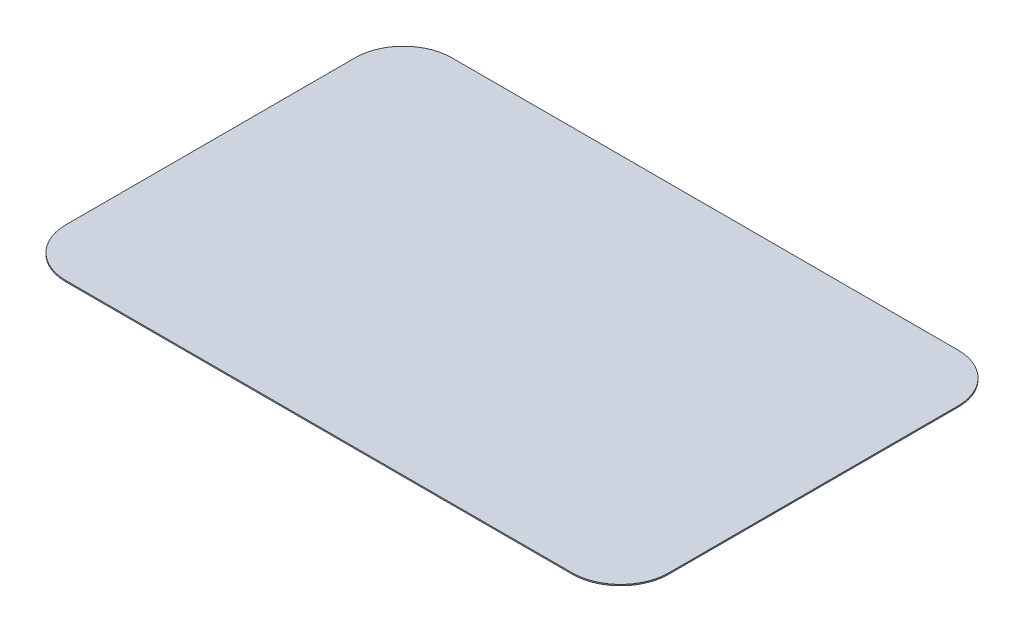
ISO-10303-21;
HEADER;
FILE_DESCRIPTION(('STEP AP214'),'2;1');
FILE_NAME('part.step','',(''),(''),'','','');
FILE_SCHEMA(('AUTOMOTIVE_DESIGN { 1 0 10303 214 1 1 1 1 }'));
ENDSEC;
DATA;
#1=APPLICATION_CONTEXT('core data for automotive mechanical design processes');
#2=APPLICATION_PROTOCOL_DEFINITION('international standard','automotive_design',2000,#1);
#3=PRODUCT_CONTEXT('',#1,'mechanical');
#4=PRODUCT('Part','Part','',(#3));
#5=PRODUCT_RELATED_PRODUCT_CATEGORY('part','',(#4));
#6=PRODUCT_DEFINITION_FORMATION('','',#4);
#7=PRODUCT_DEFINITION_CONTEXT('part definition',#1,'design');
#8=PRODUCT_DEFINITION('design','',#6,#7);
#9=PRODUCT_DEFINITION_SHAPE('','',#8);
#10=(LENGTH_UNIT() NAMED_UNIT(*) SI_UNIT(.MILLI.,.METRE.));
#11=(NAMED_UNIT(*) PLANE_ANGLE_UNIT() SI_UNIT($,.RADIAN.));
#12=(NAMED_UNIT(*) SI_UNIT($,.STERADIAN.) SOLID_ANGLE_UNIT());
#13=UNCERTAINTY_MEASURE_WITH_UNIT(LENGTH_MEASURE(1.E-05),#10,'distance_accuracy_value','');
#14=(GEOMETRIC_REPRESENTATION_CONTEXT(3) GLOBAL_UNCERTAINTY_ASSIGNED_CONTEXT((#13)) GLOBAL_UNIT_ASSIGNED_CONTEXT((#10,
#11,#12)) REPRESENTATION_CONTEXT('',''));
#15=CARTESIAN_POINT('',(0.,0.,0.));
#16=DIRECTION('',(0.,0.,1.));
#17=DIRECTION('',(1.,0.,0.));
#18=AXIS2_PLACEMENT_3D('',#15,#16,#17);
#19=CARTESIAN_POINT('',(-2.1,1.1,1.2));
#20=DIRECTION('',(0.,-1.,0.));
#21=DIRECTION('',(0.,0.,-1.));
#22=AXIS2_PLACEMENT_3D('',#19,#20,#21);
#23=PLANE('',#22);
#24=CARTESIAN_POINT('',(2.1,1.1,1.2));
#25=DIRECTION('',(0.,-1.,0.));
#26=DIRECTION('',(0.,0.,-1.));
#27=AXIS2_PLACEMENT_3D('',#24,#25,#26);
#28=CIRCLE('',#27,0.4);
#29=CARTESIAN_POINT('',(2.1,1.1,1.6));
#30=VERTEX_POINT('',#29);
#31=CARTESIAN_POINT('',(2.5,1.1,1.2));
#32=VERTEX_POINT('',#31);
#33=EDGE_CURVE('E110',#30,#32,#28,.F.);
#34=ORIENTED_EDGE('',*,*,#33,.F.);
#35=DIRECTION('',(-1.,0.,0.));
#36=VECTOR('',#35,1.);
#37=CARTESIAN_POINT('',(2.1,1.1,1.6));
#38=LINE('',#37,#36);
#39=CARTESIAN_POINT('',(-2.1,1.1,1.6));
#40=VERTEX_POINT('',#39);
#41=EDGE_CURVE('E104',#30,#40,#38,.T.);
#42=ORIENTED_EDGE('',*,*,#41,.T.);
#43=CARTESIAN_POINT('',(-2.1,1.1,1.2));
#44=DIRECTION('',(0.,-1.,0.));
#45=DIRECTION('',(0.,0.,-1.));
#46=AXIS2_PLACEMENT_3D('',#43,#44,#45);
#47=CIRCLE('',#46,0.4);
#48=CARTESIAN_POINT('',(-2.5,1.1,1.2));
#49=VERTEX_POINT('',#48);
#50=EDGE_CURVE('E91',#49,#40,#47,.F.);
#51=ORIENTED_EDGE('',*,*,#50,.F.);
#52=DIRECTION('',(0.,0.,-1.));
#53=VECTOR('',#52,1.);
#54=CARTESIAN_POINT('',(-2.5,1.1,1.2));
#55=LINE('',#54,#53);
#56=CARTESIAN_POINT('',(-2.5,1.1,-1.2));
#57=VERTEX_POINT('',#56);
#58=EDGE_CURVE('E88',#49,#57,#55,.T.);
#59=ORIENTED_EDGE('',*,*,#58,.T.);
#60=CARTESIAN_POINT('',(-2.1,1.1,-1.2));
#61=DIRECTION('',(0.,-1.,0.));
#62=DIRECTION('',(0.,0.,-1.));
#63=AXIS2_PLACEMENT_3D('',#60,#61,#62);
#64=CIRCLE('',#63,0.4);
#65=CARTESIAN_POINT('',(-2.1,1.1,-1.6));
#66=VERTEX_POINT('',#65);
#67=EDGE_CURVE('E20',#66,#57,#64,.F.);
#68=ORIENTED_EDGE('',*,*,#67,.F.);
#69=DIRECTION('',(1.,0.,0.));
#70=VECTOR('',#69,1.);
#71=CARTESIAN_POINT('',(2.1,1.1,-1.6));
#72=LINE('',#71,#70);
#73=CARTESIAN_POINT('',(2.1,1.1,-1.6));
#74=VERTEX_POINT('',#73);
#75=EDGE_CURVE('E100',#66,#74,#72,.T.);
#76=ORIENTED_EDGE('',*,*,#75,.T.);
#77=CARTESIAN_POINT('',(2.1,1.1,-1.2));
#78=DIRECTION('',(0.,-1.,0.));
#79=DIRECTION('',(0.,0.,-1.));
#80=AXIS2_PLACEMENT_3D('',#77,#78,#79);
#81=CIRCLE('',#80,0.4);
#82=CARTESIAN_POINT('',(2.5,1.1,-1.2));
#83=VERTEX_POINT('',#82);
#84=EDGE_CURVE('E112',#83,#74,#81,.F.);
#85=ORIENTED_EDGE('',*,*,#84,.F.);
#86=DIRECTION('',(0.,0.,1.));
#87=VECTOR('',#86,1.);
#88=CARTESIAN_POINT('',(2.5,1.1,1.2));
#89=LINE('',#88,#87);
#90=EDGE_CURVE('E107',#83,#32,#89,.T.);
#91=ORIENTED_EDGE('',*,*,#90,.T.);
#92=EDGE_LOOP('',(#34,#42,#51,#59,#68,#76,#85,#91));
#93=FACE_BOUND('',#92,.T.);
#94=ADVANCED_FACE('F17',(#93),#23,.T.);
#95=CARTESIAN_POINT('',(-2.5,1.11,1.2));
#96=DIRECTION('',(1.,0.,0.));
#97=DIRECTION('',(0.,0.,-1.));
#98=AXIS2_PLACEMENT_3D('',#95,#96,#97);
#99=PLANE('',#98);
#100=DIRECTION('',(0.,-1.,0.));
#101=VECTOR('',#100,1.);
#102=CARTESIAN_POINT('',(-2.5,1.11,1.2));
#103=LINE('',#102,#101);
#104=CARTESIAN_POINT('',(-2.5,1.11,1.2));
#105=VERTEX_POINT('',#104);
#106=EDGE_CURVE('E136',#105,#49,#103,.T.);
#107=ORIENTED_EDGE('',*,*,#106,.F.);
#108=DIRECTION('',(0.,0.,-1.));
#109=VECTOR('',#108,1.);
#110=CARTESIAN_POINT('',(-2.5,1.11,1.2));
#111=LINE('',#110,#109);
#112=CARTESIAN_POINT('',(-2.5,1.11,-1.2));
#113=VERTEX_POINT('',#112);
#114=EDGE_CURVE('E98',#105,#113,#111,.T.);
#115=ORIENTED_EDGE('',*,*,#114,.T.);
#116=DIRECTION('',(0.,-1.,0.));
#117=VECTOR('',#116,1.);
#118=CARTESIAN_POINT('',(-2.5,1.11,-1.2));
#119=LINE('',#118,#117);
#120=EDGE_CURVE('E85',#57,#113,#119,.F.);
#121=ORIENTED_EDGE('',*,*,#120,.F.);
#122=ORIENTED_EDGE('',*,*,#58,.F.);
#123=EDGE_LOOP('',(#107,#115,#121,#122));
#124=FACE_BOUND('',#123,.T.);
#125=ADVANCED_FACE('F97',(#124),#99,.F.);
#126=CARTESIAN_POINT('',(-2.1,1.11,-1.2));
#127=DIRECTION('',(0.,-1.,0.));
#128=DIRECTION('',(0.,0.,-1.));
#129=AXIS2_PLACEMENT_3D('',#126,#127,#128);
#130=CYLINDRICAL_SURFACE('',#129,0.4);
#131=CARTESIAN_POINT('',(-2.1,1.11,-1.2));
#132=DIRECTION('',(0.,-1.,0.));
#133=DIRECTION('',(0.,0.,-1.));
#134=AXIS2_PLACEMENT_3D('',#131,#132,#133);
#135=CIRCLE('',#134,0.4);
#136=CARTESIAN_POINT('',(-2.1,1.11,-1.6));
#137=VERTEX_POINT('',#136);
#138=EDGE_CURVE('E122',#113,#137,#135,.T.);
#139=ORIENTED_EDGE('',*,*,#138,.T.);
#140=DIRECTION('',(0.,1.,0.));
#141=VECTOR('',#140,1.);
#142=CARTESIAN_POINT('',(-2.1,1.11,-1.6));
#143=LINE('',#142,#141);
#144=EDGE_CURVE('E87',#137,#66,#143,.F.);
#145=ORIENTED_EDGE('',*,*,#144,.T.);
#146=ORIENTED_EDGE('',*,*,#67,.T.);
#147=ORIENTED_EDGE('',*,*,#120,.T.);
#148=EDGE_LOOP('',(#139,#145,#146,#147));
#149=FACE_BOUND('',#148,.T.);
#150=ADVANCED_FACE('F83',(#149),#130,.T.);
#151=CARTESIAN_POINT('',(2.1,1.11,-1.6));
#152=DIRECTION('',(0.,0.,1.));
#153=DIRECTION('',(1.,0.,0.));
#154=AXIS2_PLACEMENT_3D('',#151,#152,#153);
#155=PLANE('',#154);
#156=ORIENTED_EDGE('',*,*,#144,.F.);
#157=DIRECTION('',(1.,0.,0.));
#158=VECTOR('',#157,1.);
#159=CARTESIAN_POINT('',(-2.1,1.11,-1.6));
#160=LINE('',#159,#158);
#161=CARTESIAN_POINT('',(2.1,1.11,-1.6));
#162=VERTEX_POINT('',#161);
#163=EDGE_CURVE('E121',#137,#162,#160,.T.);
#164=ORIENTED_EDGE('',*,*,#163,.T.);
#165=DIRECTION('',(0.,-1.,0.));
#166=VECTOR('',#165,1.);
#167=CARTESIAN_POINT('',(2.1,1.11,-1.6));
#168=LINE('',#167,#166);
#169=EDGE_CURVE('E126',#74,#162,#168,.F.);
#170=ORIENTED_EDGE('',*,*,#169,.F.);
#171=ORIENTED_EDGE('',*,*,#75,.F.);
#172=EDGE_LOOP('',(#156,#164,#170,#171));
#173=FACE_BOUND('',#172,.T.);
#174=ADVANCED_FACE('F162',(#173),#155,.F.);
#175=CARTESIAN_POINT('',(2.1,1.11,-1.2));
#176=DIRECTION('',(0.,-1.,0.));
#177=DIRECTION('',(0.,0.,-1.));
#178=AXIS2_PLACEMENT_3D('',#175,#176,#177);
#179=CYLINDRICAL_SURFACE('',#178,0.4);
#180=CARTESIAN_POINT('',(2.1,1.11,-1.2));
#181=DIRECTION('',(0.,-1.,0.));
#182=DIRECTION('',(0.,0.,-1.));
#183=AXIS2_PLACEMENT_3D('',#180,#181,#182);
#184=CIRCLE('',#183,0.4);
#185=CARTESIAN_POINT('',(2.5,1.11,-1.2));
#186=VERTEX_POINT('',#185);
#187=EDGE_CURVE('E118',#162,#186,#184,.T.);
#188=ORIENTED_EDGE('',*,*,#187,.T.);
#189=DIRECTION('',(0.,1.,0.));
#190=VECTOR('',#189,1.);
#191=CARTESIAN_POINT('',(2.5,1.11,-1.2));
#192=LINE('',#191,#190);
#193=EDGE_CURVE('E111',#186,#83,#192,.F.);
#194=ORIENTED_EDGE('',*,*,#193,.T.);
#195=ORIENTED_EDGE('',*,*,#84,.T.);
#196=ORIENTED_EDGE('',*,*,#169,.T.);
#197=EDGE_LOOP('',(#188,#194,#195,#196));
#198=FACE_BOUND('',#197,.T.);
#199=ADVANCED_FACE('F160',(#198),#179,.T.);
#200=CARTESIAN_POINT('',(2.5,1.11,1.2));
#201=DIRECTION('',(-1.,0.,0.));
#202=DIRECTION('',(0.,0.,1.));
#203=AXIS2_PLACEMENT_3D('',#200,#201,#202);
#204=PLANE('',#203);
#205=ORIENTED_EDGE('',*,*,#193,.F.);
#206=DIRECTION('',(0.,0.,-1.));
#207=VECTOR('',#206,1.);
#208=CARTESIAN_POINT('',(2.5,1.11,1.2));
#209=LINE('',#208,#207);
#210=CARTESIAN_POINT('',(2.5,1.11,1.2));
#211=VERTEX_POINT('',#210);
#212=EDGE_CURVE('E117',#186,#211,#209,.F.);
#213=ORIENTED_EDGE('',*,*,#212,.T.);
#214=DIRECTION('',(0.,-1.,0.));
#215=VECTOR('',#214,1.);
#216=CARTESIAN_POINT('',(2.5,1.11,1.2));
#217=LINE('',#216,#215);
#218=EDGE_CURVE('E125',#32,#211,#217,.F.);
#219=ORIENTED_EDGE('',*,*,#218,.F.);
#220=ORIENTED_EDGE('',*,*,#90,.F.);
#221=EDGE_LOOP('',(#205,#213,#219,#220));
#222=FACE_BOUND('',#221,.T.);
#223=ADVANCED_FACE('F158',(#222),#204,.F.);
#224=CARTESIAN_POINT('',(2.1,1.11,1.2));
#225=DIRECTION('',(0.,-1.,0.));
#226=DIRECTION('',(0.,0.,-1.));
#227=AXIS2_PLACEMENT_3D('',#224,#225,#226);
#228=CYLINDRICAL_SURFACE('',#227,0.4);
#229=CARTESIAN_POINT('',(2.1,1.11,1.2));
#230=DIRECTION('',(0.,-1.,0.));
#231=DIRECTION('',(0.,0.,-1.));
#232=AXIS2_PLACEMENT_3D('',#229,#230,#231);
#233=CIRCLE('',#232,0.4);
#234=CARTESIAN_POINT('',(2.1,1.11,1.6));
#235=VERTEX_POINT('',#234);
#236=EDGE_CURVE('E114',#211,#235,#233,.T.);
#237=ORIENTED_EDGE('',*,*,#236,.T.);
#238=DIRECTION('',(0.,1.,0.));
#239=VECTOR('',#238,1.);
#240=CARTESIAN_POINT('',(2.1,1.11,1.6));
#241=LINE('',#240,#239);
#242=EDGE_CURVE('E106',#235,#30,#241,.F.);
#243=ORIENTED_EDGE('',*,*,#242,.T.);
#244=ORIENTED_EDGE('',*,*,#33,.T.);
#245=ORIENTED_EDGE('',*,*,#218,.T.);
#246=EDGE_LOOP('',(#237,#243,#244,#245));
#247=FACE_BOUND('',#246,.T.);
#248=ADVANCED_FACE('F154',(#247),#228,.T.);
#249=CARTESIAN_POINT('',(2.1,1.11,1.6));
#250=DIRECTION('',(0.,0.,-1.));
#251=DIRECTION('',(-1.,0.,0.));
#252=AXIS2_PLACEMENT_3D('',#249,#250,#251);
#253=PLANE('',#252);
#254=ORIENTED_EDGE('',*,*,#242,.F.);
#255=DIRECTION('',(1.,0.,0.));
#256=VECTOR('',#255,1.);
#257=CARTESIAN_POINT('',(-2.1,1.11,1.6));
#258=LINE('',#257,#256);
#259=CARTESIAN_POINT('',(-2.1,1.11,1.6));
#260=VERTEX_POINT('',#259);
#261=EDGE_CURVE('E26',#235,#260,#258,.F.);
#262=ORIENTED_EDGE('',*,*,#261,.T.);
#263=DIRECTION('',(0.,-1.,0.));
#264=VECTOR('',#263,1.);
#265=CARTESIAN_POINT('',(-2.1,1.11,1.6));
#266=LINE('',#265,#264);
#267=EDGE_CURVE('E34',#40,#260,#266,.F.);
#268=ORIENTED_EDGE('',*,*,#267,.F.);
#269=ORIENTED_EDGE('',*,*,#41,.F.);
#270=EDGE_LOOP('',(#254,#262,#268,#269));
#271=FACE_BOUND('',#270,.T.);
#272=ADVANCED_FACE('F147',(#271),#253,.F.);
#273=CARTESIAN_POINT('',(-2.1,1.11,1.2));
#274=DIRECTION('',(0.,-1.,0.));
#275=DIRECTION('',(0.,0.,-1.));
#276=AXIS2_PLACEMENT_3D('',#273,#274,#275);
#277=CYLINDRICAL_SURFACE('',#276,0.4);
#278=CARTESIAN_POINT('',(-2.1,1.11,1.2));
#279=DIRECTION('',(0.,-1.,0.));
#280=DIRECTION('',(0.,0.,-1.));
#281=AXIS2_PLACEMENT_3D('',#278,#279,#280);
#282=CIRCLE('',#281,0.4);
#283=EDGE_CURVE('E11',#260,#105,#282,.T.);
#284=ORIENTED_EDGE('',*,*,#283,.T.);
#285=ORIENTED_EDGE('',*,*,#106,.T.);
#286=ORIENTED_EDGE('',*,*,#50,.T.);
#287=ORIENTED_EDGE('',*,*,#267,.T.);
#288=EDGE_LOOP('',(#284,#285,#286,#287));
#289=FACE_BOUND('',#288,.T.);
#290=ADVANCED_FACE('F173',(#289),#277,.T.);
#291=CARTESIAN_POINT('',(-2.1,1.11,1.2));
#292=DIRECTION('',(0.,-1.,0.));
#293=DIRECTION('',(0.,0.,-1.));
#294=AXIS2_PLACEMENT_3D('',#291,#292,#293);
#295=PLANE('',#294);
#296=ORIENTED_EDGE('',*,*,#261,.F.);
#297=ORIENTED_EDGE('',*,*,#236,.F.);
#298=ORIENTED_EDGE('',*,*,#212,.F.);
#299=ORIENTED_EDGE('',*,*,#187,.F.);
#300=ORIENTED_EDGE('',*,*,#163,.F.);
#301=ORIENTED_EDGE('',*,*,#138,.F.);
#302=ORIENTED_EDGE('',*,*,#114,.F.);
#303=ORIENTED_EDGE('',*,*,#283,.F.);
#304=EDGE_LOOP('',(#296,#297,#298,#299,#300,#301,#302,#303));
#305=FACE_BOUND('',#304,.T.);
#306=ADVANCED_FACE('F151',(#305),#295,.F.);
#307=CLOSED_SHELL('',(#94,#125,#150,#174,#199,#223,#248,#272,#290,#306));
#308=MANIFOLD_SOLID_BREP('B1',#307);
#309=ADVANCED_BREP_SHAPE_REPRESENTATION('',(#18,#308),#14);
#310=SHAPE_DEFINITION_REPRESENTATION(#9,#309);
ENDSEC;
END-ISO-10303-21;
